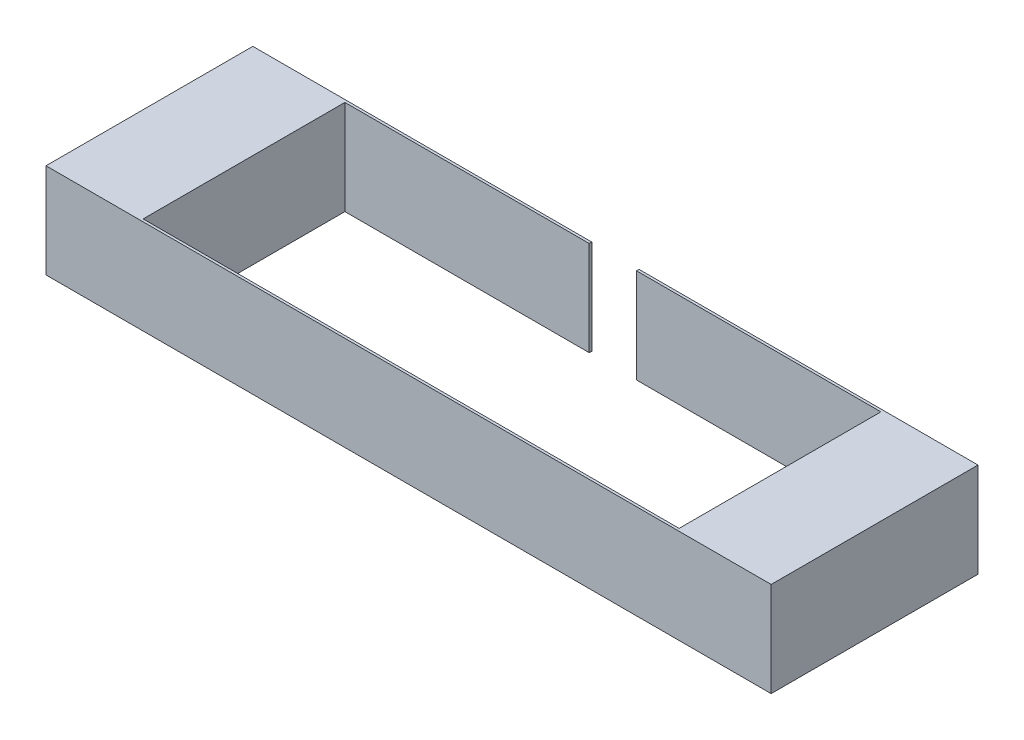
ISO-10303-21;
HEADER;
FILE_DESCRIPTION(('STEP AP214'),'2;1');
FILE_NAME('part.step','',(''),(''),'','','');
FILE_SCHEMA(('AUTOMOTIVE_DESIGN { 1 0 10303 214 1 1 1 1 }'));
ENDSEC;
DATA;
#1=APPLICATION_CONTEXT('core data for automotive mechanical design processes');
#2=APPLICATION_PROTOCOL_DEFINITION('international standard','automotive_design',2000,#1);
#3=PRODUCT_CONTEXT('',#1,'mechanical');
#4=PRODUCT('Part','Part','',(#3));
#5=PRODUCT_RELATED_PRODUCT_CATEGORY('part','',(#4));
#6=PRODUCT_DEFINITION_FORMATION('','',#4);
#7=PRODUCT_DEFINITION_CONTEXT('part definition',#1,'design');
#8=PRODUCT_DEFINITION('design','',#6,#7);
#9=PRODUCT_DEFINITION_SHAPE('','',#8);
#10=(LENGTH_UNIT() NAMED_UNIT(*) SI_UNIT(.MILLI.,.METRE.));
#11=(NAMED_UNIT(*) PLANE_ANGLE_UNIT() SI_UNIT($,.RADIAN.));
#12=(NAMED_UNIT(*) SI_UNIT($,.STERADIAN.) SOLID_ANGLE_UNIT());
#13=UNCERTAINTY_MEASURE_WITH_UNIT(LENGTH_MEASURE(1.E-05),#10,'distance_accuracy_value','');
#14=(GEOMETRIC_REPRESENTATION_CONTEXT(3) GLOBAL_UNCERTAINTY_ASSIGNED_CONTEXT((#13)) GLOBAL_UNIT_ASSIGNED_CONTEXT((#10,
#11,#12)) REPRESENTATION_CONTEXT('',''));
#15=CARTESIAN_POINT('',(0.,0.,0.));
#16=DIRECTION('',(0.,0.,1.));
#17=DIRECTION('',(1.,0.,0.));
#18=AXIS2_PLACEMENT_3D('',#15,#16,#17);
#19=CARTESIAN_POINT('',(107.95,-19.05,-41.656));
#20=DIRECTION('',(0.,0.,1.));
#21=DIRECTION('',(1.,0.,0.));
#22=AXIS2_PLACEMENT_3D('',#19,#20,#21);
#23=PLANE('',#22);
#24=DIRECTION('',(-1.,0.,0.));
#25=VECTOR('',#24,1.);
#26=CARTESIAN_POINT('',(107.95,-19.0499999999999,-41.656));
#27=LINE('',#26,#25);
#28=CARTESIAN_POINT('',(146.05,-19.0499999999999,-41.656));
#29=VERTEX_POINT('',#28);
#30=CARTESIAN_POINT('',(9.525,-19.0500000000001,-41.656));
#31=VERTEX_POINT('',#30);
#32=EDGE_CURVE('E235',#29,#31,#27,.T.);
#33=ORIENTED_EDGE('',*,*,#32,.T.);
#34=DIRECTION('',(0.,-1.,0.));
#35=VECTOR('',#34,1.);
#36=CARTESIAN_POINT('',(9.525,-19.0500000000001,-41.656));
#37=LINE('',#36,#35);
#38=CARTESIAN_POINT('',(9.525,19.0500000000001,-41.656));
#39=VERTEX_POINT('',#38);
#40=EDGE_CURVE('E248',#39,#31,#37,.T.);
#41=ORIENTED_EDGE('',*,*,#40,.F.);
#42=DIRECTION('',(1.,0.,0.));
#43=VECTOR('',#42,1.);
#44=CARTESIAN_POINT('',(107.95,19.0500000000001,-41.656));
#45=LINE('',#44,#43);
#46=CARTESIAN_POINT('',(146.05,19.0500000000001,-41.656));
#47=VERTEX_POINT('',#46);
#48=EDGE_CURVE('E169',#39,#47,#45,.T.);
#49=ORIENTED_EDGE('',*,*,#48,.T.);
#50=DIRECTION('',(0.,-1.,0.));
#51=VECTOR('',#50,1.);
#52=CARTESIAN_POINT('',(146.05,-19.0499999999999,-41.656));
#53=LINE('',#52,#51);
#54=EDGE_CURVE('E167',#47,#29,#53,.T.);
#55=ORIENTED_EDGE('',*,*,#54,.T.);
#56=EDGE_LOOP('',(#33,#41,#49,#55));
#57=FACE_BOUND('',#56,.T.);
#58=ADVANCED_FACE('F45',(#57),#23,.F.);
#59=CARTESIAN_POINT('',(107.95,-19.05,-40.64));
#60=DIRECTION('',(0.,0.,-1.));
#61=DIRECTION('',(-1.,0.,0.));
#62=AXIS2_PLACEMENT_3D('',#59,#60,#61);
#63=PLANE('',#62);
#64=DIRECTION('',(-1.,0.,0.));
#65=VECTOR('',#64,1.);
#66=CARTESIAN_POINT('',(107.95,19.05,-40.64));
#67=LINE('',#66,#65);
#68=CARTESIAN_POINT('',(107.95,19.05,-40.64));
#69=VERTEX_POINT('',#68);
#70=CARTESIAN_POINT('',(9.525,19.0500000000001,-40.64));
#71=VERTEX_POINT('',#70);
#72=EDGE_CURVE('E163',#69,#71,#67,.T.);
#73=ORIENTED_EDGE('',*,*,#72,.T.);
#74=DIRECTION('',(0.,1.,0.));
#75=VECTOR('',#74,1.);
#76=CARTESIAN_POINT('',(9.525,-19.0500000000001,-40.64));
#77=LINE('',#76,#75);
#78=CARTESIAN_POINT('',(9.52500000000001,-19.05,-40.64));
#79=VERTEX_POINT('',#78);
#80=EDGE_CURVE('E140',#79,#71,#77,.T.);
#81=ORIENTED_EDGE('',*,*,#80,.F.);
#82=DIRECTION('',(-1.,0.,0.));
#83=VECTOR('',#82,1.);
#84=CARTESIAN_POINT('',(107.95,-19.05,-40.64));
#85=LINE('',#84,#83);
#86=CARTESIAN_POINT('',(107.95,-19.05,-40.64));
#87=VERTEX_POINT('',#86);
#88=EDGE_CURVE('E155',#87,#79,#85,.T.);
#89=ORIENTED_EDGE('',*,*,#88,.F.);
#90=DIRECTION('',(0.,-1.,0.));
#91=VECTOR('',#90,1.);
#92=CARTESIAN_POINT('',(107.95,-19.05,-40.64));
#93=LINE('',#92,#91);
#94=EDGE_CURVE('E156',#69,#87,#93,.T.);
#95=ORIENTED_EDGE('',*,*,#94,.F.);
#96=EDGE_LOOP('',(#73,#81,#89,#95));
#97=FACE_BOUND('',#96,.T.);
#98=ADVANCED_FACE('F265',(#97),#63,.F.);
#99=CARTESIAN_POINT('',(107.95,-19.0499999999999,-95.5375367264149));
#100=DIRECTION('',(-1.,0.,0.));
#101=DIRECTION('',(0.,0.,1.));
#102=AXIS2_PLACEMENT_3D('',#99,#100,#101);
#103=PLANE('',#102);
#104=DIRECTION('',(0.,0.,1.));
#105=VECTOR('',#104,1.);
#106=CARTESIAN_POINT('',(107.95,19.0500000000001,-95.5375367264149));
#107=LINE('',#106,#105);
#108=CARTESIAN_POINT('',(107.95,19.0500000000001,40.64));
#109=VERTEX_POINT('',#108);
#110=EDGE_CURVE('E170',#69,#109,#107,.T.);
#111=ORIENTED_EDGE('',*,*,#110,.F.);
#112=ORIENTED_EDGE('',*,*,#94,.T.);
#113=DIRECTION('',(0.,0.,1.));
#114=VECTOR('',#113,1.);
#115=CARTESIAN_POINT('',(107.95,-19.0499999999999,-95.5375367264149));
#116=LINE('',#115,#114);
#117=CARTESIAN_POINT('',(107.95,-19.0499999999999,40.64));
#118=VERTEX_POINT('',#117);
#119=EDGE_CURVE('E176',#87,#118,#116,.T.);
#120=ORIENTED_EDGE('',*,*,#119,.T.);
#121=DIRECTION('',(0.,1.,0.));
#122=VECTOR('',#121,1.);
#123=CARTESIAN_POINT('',(107.95,-19.0499999999999,40.64));
#124=LINE('',#123,#122);
#125=EDGE_CURVE('E197',#118,#109,#124,.T.);
#126=ORIENTED_EDGE('',*,*,#125,.T.);
#127=EDGE_LOOP('',(#111,#112,#120,#126));
#128=FACE_BOUND('',#127,.T.);
#129=ADVANCED_FACE('F268',(#128),#103,.T.);
#130=CARTESIAN_POINT('',(107.95,-19.0499999999999,40.64));
#131=DIRECTION('',(0.,0.,1.));
#132=DIRECTION('',(0.,-1.,0.));
#133=AXIS2_PLACEMENT_3D('',#130,#131,#132);
#134=PLANE('',#133);
#135=DIRECTION('',(0.,1.,0.));
#136=VECTOR('',#135,1.);
#137=CARTESIAN_POINT('',(-107.95,-19.0499999999999,40.64));
#138=LINE('',#137,#136);
#139=CARTESIAN_POINT('',(-107.95,-19.0499999999999,40.64));
#140=VERTEX_POINT('',#139);
#141=CARTESIAN_POINT('',(-107.95,19.0500000000001,40.64));
#142=VERTEX_POINT('',#141);
#143=EDGE_CURVE('E198',#140,#142,#138,.T.);
#144=ORIENTED_EDGE('',*,*,#143,.T.);
#145=DIRECTION('',(-1.,0.,0.));
#146=VECTOR('',#145,1.);
#147=CARTESIAN_POINT('',(107.95,19.0500000000001,40.64));
#148=LINE('',#147,#146);
#149=EDGE_CURVE('E12',#109,#142,#148,.T.);
#150=ORIENTED_EDGE('',*,*,#149,.F.);
#151=ORIENTED_EDGE('',*,*,#125,.F.);
#152=DIRECTION('',(-1.,0.,0.));
#153=VECTOR('',#152,1.);
#154=CARTESIAN_POINT('',(107.95,-19.0499999999999,40.64));
#155=LINE('',#154,#153);
#156=EDGE_CURVE('E191',#118,#140,#155,.T.);
#157=ORIENTED_EDGE('',*,*,#156,.T.);
#158=EDGE_LOOP('',(#144,#150,#151,#157));
#159=FACE_BOUND('',#158,.T.);
#160=ADVANCED_FACE('F47',(#159),#134,.F.);
#161=CARTESIAN_POINT('',(107.95,19.0500000000001,41.656));
#162=DIRECTION('',(0.,-1.,0.));
#163=DIRECTION('',(0.,0.,-1.));
#164=AXIS2_PLACEMENT_3D('',#161,#162,#163);
#165=PLANE('',#164);
#166=ORIENTED_EDGE('',*,*,#48,.F.);
#167=DIRECTION('',(0.,0.,-1.));
#168=VECTOR('',#167,1.);
#169=CARTESIAN_POINT('',(9.525,19.0500000000001,41.657));
#170=LINE('',#169,#168);
#171=EDGE_CURVE('E245',#71,#39,#170,.T.);
#172=ORIENTED_EDGE('',*,*,#171,.F.);
#173=ORIENTED_EDGE('',*,*,#72,.F.);
#174=ORIENTED_EDGE('',*,*,#110,.T.);
#175=ORIENTED_EDGE('',*,*,#149,.T.);
#176=DIRECTION('',(0.,0.,1.));
#177=VECTOR('',#176,1.);
#178=CARTESIAN_POINT('',(-107.95,19.0500000000001,-95.5375367264149));
#179=LINE('',#178,#177);
#180=CARTESIAN_POINT('',(-107.95,19.0500000000001,-40.64));
#181=VERTEX_POINT('',#180);
#182=EDGE_CURVE('E218',#181,#142,#179,.T.);
#183=ORIENTED_EDGE('',*,*,#182,.F.);
#184=CARTESIAN_POINT('',(-9.52500000000001,19.05,-40.64));
#185=VERTEX_POINT('',#184);
#186=EDGE_CURVE('E158',#185,#181,#67,.T.);
#187=ORIENTED_EDGE('',*,*,#186,.F.);
#188=DIRECTION('',(0.,0.,-1.));
#189=VECTOR('',#188,1.);
#190=CARTESIAN_POINT('',(-9.525,19.0500000000001,41.657));
#191=LINE('',#190,#189);
#192=CARTESIAN_POINT('',(-9.525,19.0500000000001,-41.656));
#193=VERTEX_POINT('',#192);
#194=EDGE_CURVE('E60',#185,#193,#191,.T.);
#195=ORIENTED_EDGE('',*,*,#194,.T.);
#196=CARTESIAN_POINT('',(-146.05,19.0500000000001,-41.656));
#197=VERTEX_POINT('',#196);
#198=EDGE_CURVE('E171',#197,#193,#45,.T.);
#199=ORIENTED_EDGE('',*,*,#198,.F.);
#200=DIRECTION('',(0.,0.,1.));
#201=VECTOR('',#200,1.);
#202=CARTESIAN_POINT('',(-146.05,19.0500000000001,-95.5375367264149));
#203=LINE('',#202,#201);
#204=CARTESIAN_POINT('',(-146.05,19.0500000000001,41.656));
#205=VERTEX_POINT('',#204);
#206=EDGE_CURVE('E211',#197,#205,#203,.T.);
#207=ORIENTED_EDGE('',*,*,#206,.T.);
#208=DIRECTION('',(-1.,0.,0.));
#209=VECTOR('',#208,1.);
#210=CARTESIAN_POINT('',(107.95,19.0500000000001,41.656));
#211=LINE('',#210,#209);
#212=CARTESIAN_POINT('',(146.05,19.0500000000001,41.656));
#213=VERTEX_POINT('',#212);
#214=EDGE_CURVE('E53',#213,#205,#211,.T.);
#215=ORIENTED_EDGE('',*,*,#214,.F.);
#216=DIRECTION('',(0.,0.,1.));
#217=VECTOR('',#216,1.);
#218=CARTESIAN_POINT('',(146.05,19.0500000000001,-95.5375367264149));
#219=LINE('',#218,#217);
#220=EDGE_CURVE('E178',#47,#213,#219,.T.);
#221=ORIENTED_EDGE('',*,*,#220,.F.);
#222=EDGE_LOOP('',(#166,#172,#173,#174,#175,#183,#187,#195,#199,#207,#215,#221));
#223=FACE_BOUND('',#222,.T.);
#224=ADVANCED_FACE('F213',(#223),#165,.F.);
#225=CARTESIAN_POINT('',(107.95,-19.0499999999999,41.656));
#226=DIRECTION('',(0.,0.,-1.));
#227=DIRECTION('',(-1.,0.,0.));
#228=AXIS2_PLACEMENT_3D('',#225,#226,#227);
#229=PLANE('',#228);
#230=ORIENTED_EDGE('',*,*,#214,.T.);
#231=DIRECTION('',(0.,1.,0.));
#232=VECTOR('',#231,1.);
#233=CARTESIAN_POINT('',(-146.05,-19.0499999999999,41.656));
#234=LINE('',#233,#232);
#235=CARTESIAN_POINT('',(-146.05,-19.0499999999999,41.656));
#236=VERTEX_POINT('',#235);
#237=EDGE_CURVE('E206',#236,#205,#234,.T.);
#238=ORIENTED_EDGE('',*,*,#237,.F.);
#239=DIRECTION('',(-1.,0.,0.));
#240=VECTOR('',#239,1.);
#241=CARTESIAN_POINT('',(107.95,-19.0499999999999,41.656));
#242=LINE('',#241,#240);
#243=CARTESIAN_POINT('',(146.05,-19.0499999999999,41.656));
#244=VERTEX_POINT('',#243);
#245=EDGE_CURVE('E196',#244,#236,#242,.T.);
#246=ORIENTED_EDGE('',*,*,#245,.F.);
#247=DIRECTION('',(0.,1.,0.));
#248=VECTOR('',#247,1.);
#249=CARTESIAN_POINT('',(146.05,-19.0499999999999,41.656));
#250=LINE('',#249,#248);
#251=EDGE_CURVE('E166',#244,#213,#250,.T.);
#252=ORIENTED_EDGE('',*,*,#251,.T.);
#253=EDGE_LOOP('',(#230,#238,#246,#252));
#254=FACE_BOUND('',#253,.T.);
#255=ADVANCED_FACE('F204',(#254),#229,.F.);
#256=CARTESIAN_POINT('',(107.95,-19.0499999999999,41.656));
#257=DIRECTION('',(0.,1.,0.));
#258=DIRECTION('',(0.,0.,1.));
#259=AXIS2_PLACEMENT_3D('',#256,#257,#258);
#260=PLANE('',#259);
#261=ORIENTED_EDGE('',*,*,#88,.T.);
#262=DIRECTION('',(0.,0.,-1.));
#263=VECTOR('',#262,1.);
#264=CARTESIAN_POINT('',(9.525,-19.0500000000001,41.657));
#265=LINE('',#264,#263);
#266=EDGE_CURVE('E68',#79,#31,#265,.T.);
#267=ORIENTED_EDGE('',*,*,#266,.T.);
#268=ORIENTED_EDGE('',*,*,#32,.F.);
#269=DIRECTION('',(0.,0.,1.));
#270=VECTOR('',#269,1.);
#271=CARTESIAN_POINT('',(146.05,-19.0499999999999,-95.5375367264149));
#272=LINE('',#271,#270);
#273=EDGE_CURVE('E182',#29,#244,#272,.T.);
#274=ORIENTED_EDGE('',*,*,#273,.T.);
#275=ORIENTED_EDGE('',*,*,#245,.T.);
#276=DIRECTION('',(0.,0.,1.));
#277=VECTOR('',#276,1.);
#278=CARTESIAN_POINT('',(-146.05,-19.0499999999999,-95.5375367264149));
#279=LINE('',#278,#277);
#280=CARTESIAN_POINT('',(-146.05,-19.0499999999999,-41.656));
#281=VERTEX_POINT('',#280);
#282=EDGE_CURVE('E217',#281,#236,#279,.T.);
#283=ORIENTED_EDGE('',*,*,#282,.F.);
#284=CARTESIAN_POINT('',(-9.525,-19.0500000000001,-41.656));
#285=VERTEX_POINT('',#284);
#286=EDGE_CURVE('E149',#285,#281,#27,.T.);
#287=ORIENTED_EDGE('',*,*,#286,.F.);
#288=DIRECTION('',(0.,0.,-1.));
#289=VECTOR('',#288,1.);
#290=CARTESIAN_POINT('',(-9.525,-19.0500000000001,41.657));
#291=LINE('',#290,#289);
#292=CARTESIAN_POINT('',(-9.525,-19.0500000000001,-40.64));
#293=VERTEX_POINT('',#292);
#294=EDGE_CURVE('E134',#293,#285,#291,.T.);
#295=ORIENTED_EDGE('',*,*,#294,.F.);
#296=CARTESIAN_POINT('',(-107.95,-19.0499999999999,-40.64));
#297=VERTEX_POINT('',#296);
#298=EDGE_CURVE('E146',#293,#297,#85,.T.);
#299=ORIENTED_EDGE('',*,*,#298,.T.);
#300=DIRECTION('',(0.,0.,1.));
#301=VECTOR('',#300,1.);
#302=CARTESIAN_POINT('',(-107.95,-19.0499999999999,-95.5375367264149));
#303=LINE('',#302,#301);
#304=EDGE_CURVE('E228',#297,#140,#303,.T.);
#305=ORIENTED_EDGE('',*,*,#304,.T.);
#306=ORIENTED_EDGE('',*,*,#156,.F.);
#307=ORIENTED_EDGE('',*,*,#119,.F.);
#308=EDGE_LOOP('',(#261,#267,#268,#274,#275,#283,#287,#295,#299,#305,#306,#307));
#309=FACE_BOUND('',#308,.T.);
#310=ADVANCED_FACE('F145',(#309),#260,.F.);
#311=CARTESIAN_POINT('',(146.05,-19.0499999999999,-95.5375367264149));
#312=DIRECTION('',(1.,0.,0.));
#313=DIRECTION('',(0.,0.,-1.));
#314=AXIS2_PLACEMENT_3D('',#311,#312,#313);
#315=PLANE('',#314);
#316=ORIENTED_EDGE('',*,*,#54,.F.);
#317=ORIENTED_EDGE('',*,*,#220,.T.);
#318=ORIENTED_EDGE('',*,*,#251,.F.);
#319=ORIENTED_EDGE('',*,*,#273,.F.);
#320=EDGE_LOOP('',(#316,#317,#318,#319));
#321=FACE_BOUND('',#320,.T.);
#322=ADVANCED_FACE('F243',(#321),#315,.T.);
#323=ORIENTED_EDGE('',*,*,#198,.T.);
#324=DIRECTION('',(0.,1.,0.));
#325=VECTOR('',#324,1.);
#326=CARTESIAN_POINT('',(-9.525,-19.0500000000001,-41.656));
#327=LINE('',#326,#325);
#328=EDGE_CURVE('E234',#285,#193,#327,.T.);
#329=ORIENTED_EDGE('',*,*,#328,.F.);
#330=ORIENTED_EDGE('',*,*,#286,.T.);
#331=DIRECTION('',(0.,-1.,0.));
#332=VECTOR('',#331,1.);
#333=CARTESIAN_POINT('',(-146.05,-19.0499999999999,-41.656));
#334=LINE('',#333,#332);
#335=EDGE_CURVE('E227',#197,#281,#334,.T.);
#336=ORIENTED_EDGE('',*,*,#335,.F.);
#337=EDGE_LOOP('',(#323,#329,#330,#336));
#338=FACE_BOUND('',#337,.T.);
#339=ADVANCED_FACE('F233',(#338),#23,.F.);
#340=ORIENTED_EDGE('',*,*,#298,.F.);
#341=DIRECTION('',(0.,-1.,0.));
#342=VECTOR('',#341,1.);
#343=CARTESIAN_POINT('',(-9.525,-19.0500000000001,-40.64));
#344=LINE('',#343,#342);
#345=EDGE_CURVE('E131',#185,#293,#344,.T.);
#346=ORIENTED_EDGE('',*,*,#345,.F.);
#347=ORIENTED_EDGE('',*,*,#186,.T.);
#348=DIRECTION('',(0.,-1.,0.));
#349=VECTOR('',#348,1.);
#350=CARTESIAN_POINT('',(-107.95,-19.05,-40.64));
#351=LINE('',#350,#349);
#352=EDGE_CURVE('E154',#181,#297,#351,.T.);
#353=ORIENTED_EDGE('',*,*,#352,.T.);
#354=EDGE_LOOP('',(#340,#346,#347,#353));
#355=FACE_BOUND('',#354,.T.);
#356=ADVANCED_FACE('F152',(#355),#63,.F.);
#357=CARTESIAN_POINT('',(-107.95,-19.0499999999999,-95.5375367264149));
#358=DIRECTION('',(-1.,0.,0.));
#359=DIRECTION('',(0.,0.,1.));
#360=AXIS2_PLACEMENT_3D('',#357,#358,#359);
#361=PLANE('',#360);
#362=ORIENTED_EDGE('',*,*,#182,.T.);
#363=ORIENTED_EDGE('',*,*,#143,.F.);
#364=ORIENTED_EDGE('',*,*,#304,.F.);
#365=ORIENTED_EDGE('',*,*,#352,.F.);
#366=EDGE_LOOP('',(#362,#363,#364,#365));
#367=FACE_BOUND('',#366,.T.);
#368=ADVANCED_FACE('F276',(#367),#361,.F.);
#369=CARTESIAN_POINT('',(-146.05,-19.0499999999999,-95.5375367264149));
#370=DIRECTION('',(1.,0.,0.));
#371=DIRECTION('',(0.,0.,-1.));
#372=AXIS2_PLACEMENT_3D('',#369,#370,#371);
#373=PLANE('',#372);
#374=ORIENTED_EDGE('',*,*,#206,.F.);
#375=ORIENTED_EDGE('',*,*,#335,.T.);
#376=ORIENTED_EDGE('',*,*,#282,.T.);
#377=ORIENTED_EDGE('',*,*,#237,.T.);
#378=EDGE_LOOP('',(#374,#375,#376,#377));
#379=FACE_BOUND('',#378,.T.);
#380=ADVANCED_FACE('F221',(#379),#373,.F.);
#381=CARTESIAN_POINT('',(-9.525,-19.0500000000001,41.657));
#382=DIRECTION('',(-1.,0.,0.));
#383=DIRECTION('',(0.,0.,1.));
#384=AXIS2_PLACEMENT_3D('',#381,#382,#383);
#385=PLANE('',#384);
#386=ORIENTED_EDGE('',*,*,#345,.T.);
#387=ORIENTED_EDGE('',*,*,#294,.T.);
#388=ORIENTED_EDGE('',*,*,#328,.T.);
#389=ORIENTED_EDGE('',*,*,#194,.F.);
#390=EDGE_LOOP('',(#386,#387,#388,#389));
#391=FACE_BOUND('',#390,.T.);
#392=ADVANCED_FACE('F133',(#391),#385,.F.);
#393=CARTESIAN_POINT('',(9.525,-19.0500000000001,41.657));
#394=DIRECTION('',(1.,0.,0.));
#395=DIRECTION('',(0.,0.,-1.));
#396=AXIS2_PLACEMENT_3D('',#393,#394,#395);
#397=PLANE('',#396);
#398=ORIENTED_EDGE('',*,*,#80,.T.);
#399=ORIENTED_EDGE('',*,*,#171,.T.);
#400=ORIENTED_EDGE('',*,*,#40,.T.);
#401=ORIENTED_EDGE('',*,*,#266,.F.);
#402=EDGE_LOOP('',(#398,#399,#400,#401));
#403=FACE_BOUND('',#402,.T.);
#404=ADVANCED_FACE('F362',(#403),#397,.F.);
#405=CLOSED_SHELL('',(#58,#98,#129,#160,#224,#255,#310,#322,#339,#356,#368,#380,#392,#404));
#406=MANIFOLD_SOLID_BREP('B2',#405);
#407=ADVANCED_BREP_SHAPE_REPRESENTATION('',(#18,#406),#14);
#408=SHAPE_DEFINITION_REPRESENTATION(#9,#407);
ENDSEC;
END-ISO-10303-21;
